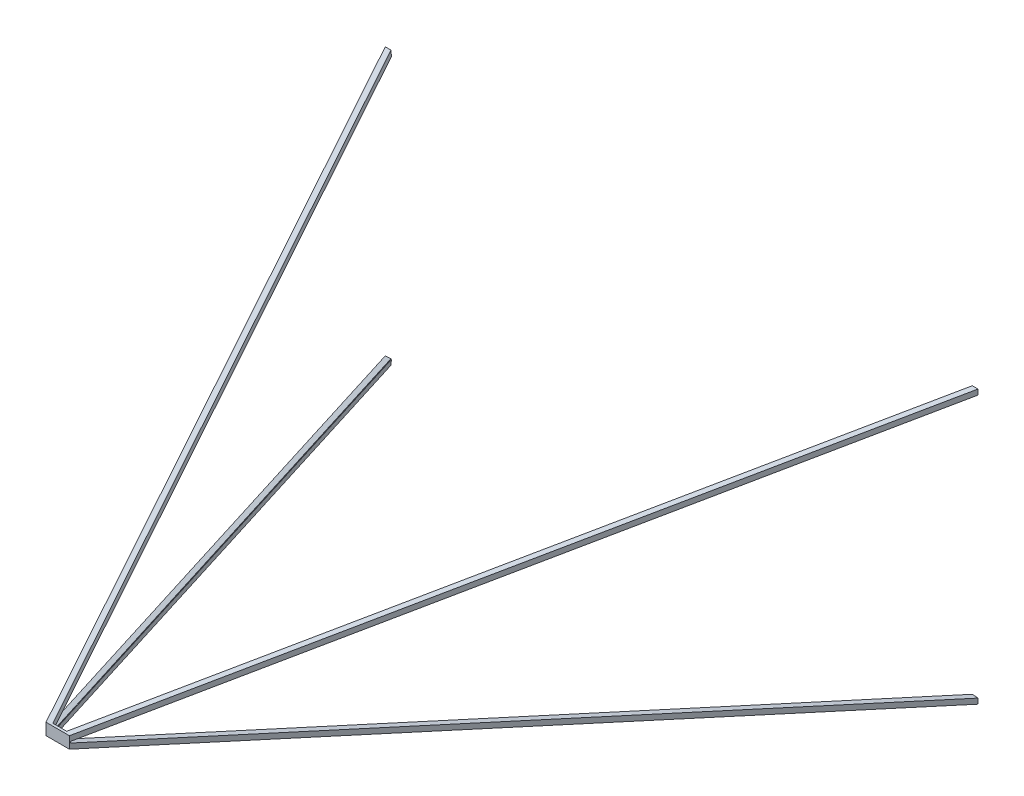
ISO-10303-21;
HEADER;
FILE_DESCRIPTION(('STEP AP214'),'2;1');
FILE_NAME('part.step','',(''),(''),'','','');
FILE_SCHEMA(('AUTOMOTIVE_DESIGN { 1 0 10303 214 1 1 1 1 }'));
ENDSEC;
DATA;
#1=APPLICATION_CONTEXT('core data for automotive mechanical design processes');
#2=APPLICATION_PROTOCOL_DEFINITION('international standard','automotive_design',2000,#1);
#3=PRODUCT_CONTEXT('',#1,'mechanical');
#4=PRODUCT('Part','Part','',(#3));
#5=PRODUCT_RELATED_PRODUCT_CATEGORY('part','',(#4));
#6=PRODUCT_DEFINITION_FORMATION('','',#4);
#7=PRODUCT_DEFINITION_CONTEXT('part definition',#1,'design');
#8=PRODUCT_DEFINITION('design','',#6,#7);
#9=PRODUCT_DEFINITION_SHAPE('','',#8);
#10=(LENGTH_UNIT() NAMED_UNIT(*) SI_UNIT(.MILLI.,.METRE.));
#11=(NAMED_UNIT(*) PLANE_ANGLE_UNIT() SI_UNIT($,.RADIAN.));
#12=(NAMED_UNIT(*) SI_UNIT($,.STERADIAN.) SOLID_ANGLE_UNIT());
#13=UNCERTAINTY_MEASURE_WITH_UNIT(LENGTH_MEASURE(1.E-05),#10,'distance_accuracy_value','');
#14=(GEOMETRIC_REPRESENTATION_CONTEXT(3) GLOBAL_UNCERTAINTY_ASSIGNED_CONTEXT((#13)) GLOBAL_UNIT_ASSIGNED_CONTEXT((#10,
#11,#12)) REPRESENTATION_CONTEXT('',''));
#15=CARTESIAN_POINT('',(0.,0.,0.));
#16=DIRECTION('',(0.,0.,1.));
#17=DIRECTION('',(1.,0.,0.));
#18=AXIS2_PLACEMENT_3D('',#15,#16,#17);
#19=CARTESIAN_POINT('',(0.,0.,2.54));
#20=DIRECTION('',(0.,0.,-1.));
#21=DIRECTION('',(-1.,0.,0.));
#22=AXIS2_PLACEMENT_3D('',#19,#20,#21);
#23=PLANE('',#22);
#24=DIRECTION('',(0.0911346627721718,-0.99583857790377,0.));
#25=VECTOR('',#24,1.);
#26=CARTESIAN_POINT('',(449.22584149141,41.1111263223435,2.54));
#27=LINE('',#26,#25);
#28=CARTESIAN_POINT('',(472.535833423273,-213.599743398054,2.54000000000002));
#29=VERTEX_POINT('',#28);
#30=CARTESIAN_POINT('',(473.327465958709,-222.25,2.53999999999999));
#31=VERTEX_POINT('',#30);
#32=EDGE_CURVE('E250',#29,#31,#27,.T.);
#33=ORIENTED_EDGE('',*,*,#32,.F.);
#34=DIRECTION('',(1.,0.,0.));
#35=VECTOR('',#34,1.);
#36=CARTESIAN_POINT('',(0.,-213.599743398054,2.54));
#37=LINE('',#36,#35);
#38=CARTESIAN_POINT('',(473.29373492651,-213.599743398054,2.54));
#39=VERTEX_POINT('',#38);
#40=EDGE_CURVE('E349',#29,#39,#37,.T.);
#41=ORIENTED_EDGE('',*,*,#40,.T.);
#42=DIRECTION('',(0.,1.,0.));
#43=VECTOR('',#42,1.);
#44=CARTESIAN_POINT('',(473.29373492651,0.,2.54));
#45=LINE('',#44,#43);
#46=CARTESIAN_POINT('',(473.29373492651,-212.895267173679,2.54000000000001));
#47=VERTEX_POINT('',#46);
#48=EDGE_CURVE('E369',#39,#47,#45,.T.);
#49=ORIENTED_EDGE('',*,*,#48,.T.);
#50=DIRECTION('',(-0.996888691620392,0.0788221829143416,0.));
#51=VECTOR('',#50,1.);
#52=CARTESIAN_POINT('',(-13.7881153001558,-174.38258765836,2.54));
#53=LINE('',#52,#51);
#54=CARTESIAN_POINT('',(482.6,-213.631096694104,2.54000000000038));
#55=VERTEX_POINT('',#54);
#56=EDGE_CURVE('E318',#55,#47,#53,.T.);
#57=ORIENTED_EDGE('',*,*,#56,.F.);
#58=DIRECTION('',(0.,1.,0.));
#59=VECTOR('',#58,1.);
#60=CARTESIAN_POINT('',(482.6,-222.25,2.54));
#61=LINE('',#60,#59);
#62=CARTESIAN_POINT('',(482.6,-222.25,2.54));
#63=VERTEX_POINT('',#62);
#64=EDGE_CURVE('E383',#63,#55,#61,.T.);
#65=ORIENTED_EDGE('',*,*,#64,.F.);
#66=DIRECTION('',(1.,0.,0.));
#67=VECTOR('',#66,1.);
#68=CARTESIAN_POINT('',(-482.6,-222.25,2.54));
#69=LINE('',#68,#67);
#70=EDGE_CURVE('E393',#31,#63,#69,.T.);
#71=ORIENTED_EDGE('',*,*,#70,.F.);
#72=EDGE_LOOP('',(#33,#41,#49,#57,#65,#71));
#73=FACE_BOUND('',#72,.T.);
#74=ADVANCED_FACE('F35',(#73),#23,.T.);
#75=CARTESIAN_POINT('',(482.6,-213.96302682185,0.804914990824813));
#76=DIRECTION('',(0.,0.978776359624033,-0.204931300296282));
#77=DIRECTION('',(0.,0.204931300296282,0.978776359624033));
#78=AXIS2_PLACEMENT_3D('',#75,#76,#77);
#79=PLANE('',#78);
#80=DIRECTION('',(0.40775601315611,-0.187120910146982,-0.893711809657229));
#81=VECTOR('',#80,1.);
#82=CARTESIAN_POINT('',(474.869163518275,-214.670518167678,-2.57414815342932));
#83=LINE('',#82,#81);
#84=CARTESIAN_POINT('',(12.84875008994,-2.64745173138731,1010.07333333333));
#85=VERTEX_POINT('',#84);
#86=EDGE_CURVE('E11',#85,#29,#83,.T.);
#87=ORIENTED_EDGE('',*,*,#86,.F.);
#88=DIRECTION('',(-1.,0.,0.));
#89=VECTOR('',#88,1.);
#90=CARTESIAN_POINT('',(0.,-2.64745173138712,1010.07333333333));
#91=LINE('',#90,#89);
#92=CARTESIAN_POINT('',(13.6066515931767,-2.64745173138715,1010.07333333333));
#93=VERTEX_POINT('',#92);
#94=EDGE_CURVE('E324',#93,#85,#91,.T.);
#95=ORIENTED_EDGE('',*,*,#94,.F.);
#96=DIRECTION('',(-0.407756013156111,0.187120910146982,0.893711809657229));
#97=VECTOR('',#96,1.);
#98=CARTESIAN_POINT('',(475.501052553644,-214.612690528314,-2.29795644303397));
#99=LINE('',#98,#97);
#100=EDGE_CURVE('E327',#39,#93,#99,.T.);
#101=ORIENTED_EDGE('',*,*,#100,.F.);
#102=ORIENTED_EDGE('',*,*,#40,.F.);
#103=EDGE_LOOP('',(#87,#95,#101,#102));
#104=FACE_BOUND('',#103,.T.);
#105=ADVANCED_FACE('F501',(#104),#79,.T.);
#106=DIRECTION('',(-0.0911346627721718,0.99583857790377,0.));
#107=VECTOR('',#106,1.);
#108=CARTESIAN_POINT('',(-449.22584149141,-41.1111263223434,2.54));
#109=LINE('',#108,#107);
#110=CARTESIAN_POINT('',(-472.535833423273,213.599743398054,2.54000000000002));
#111=VERTEX_POINT('',#110);
#112=CARTESIAN_POINT('',(-473.327465958709,222.25,2.53999999999999));
#113=VERTEX_POINT('',#112);
#114=EDGE_CURVE('E273',#111,#113,#109,.T.);
#115=ORIENTED_EDGE('',*,*,#114,.F.);
#116=DIRECTION('',(-1.,0.,0.));
#117=VECTOR('',#116,1.);
#118=CARTESIAN_POINT('',(0.,213.599743398054,2.54));
#119=LINE('',#118,#117);
#120=CARTESIAN_POINT('',(-473.29373492651,213.599743398054,2.54));
#121=VERTEX_POINT('',#120);
#122=EDGE_CURVE('E355',#111,#121,#119,.T.);
#123=ORIENTED_EDGE('',*,*,#122,.T.);
#124=DIRECTION('',(0.,-1.,0.));
#125=VECTOR('',#124,1.);
#126=CARTESIAN_POINT('',(-473.29373492651,0.,2.54));
#127=LINE('',#126,#125);
#128=CARTESIAN_POINT('',(-473.29373492651,212.895267173679,2.54000000000001));
#129=VERTEX_POINT('',#128);
#130=EDGE_CURVE('E363',#121,#129,#127,.T.);
#131=ORIENTED_EDGE('',*,*,#130,.T.);
#132=DIRECTION('',(0.996888691620392,-0.0788221829143416,0.));
#133=VECTOR('',#132,1.);
#134=CARTESIAN_POINT('',(13.7881153001558,174.38258765836,2.54));
#135=LINE('',#134,#133);
#136=CARTESIAN_POINT('',(-482.6,213.631096694104,2.54000000000013));
#137=VERTEX_POINT('',#136);
#138=EDGE_CURVE('E294',#137,#129,#135,.T.);
#139=ORIENTED_EDGE('',*,*,#138,.F.);
#140=DIRECTION('',(0.,-1.,0.));
#141=VECTOR('',#140,1.);
#142=CARTESIAN_POINT('',(-482.6,222.25,2.54));
#143=LINE('',#142,#141);
#144=CARTESIAN_POINT('',(-482.6,222.25,2.54));
#145=VERTEX_POINT('',#144);
#146=EDGE_CURVE('E376',#145,#137,#143,.T.);
#147=ORIENTED_EDGE('',*,*,#146,.F.);
#148=DIRECTION('',(-1.,0.,0.));
#149=VECTOR('',#148,1.);
#150=CARTESIAN_POINT('',(482.6,222.25,2.54));
#151=LINE('',#150,#149);
#152=EDGE_CURVE('E403',#113,#145,#151,.T.);
#153=ORIENTED_EDGE('',*,*,#152,.F.);
#154=EDGE_LOOP('',(#115,#123,#131,#139,#147,#153));
#155=FACE_BOUND('',#154,.T.);
#156=ADVANCED_FACE('F433',(#155),#23,.T.);
#157=CARTESIAN_POINT('',(-482.6,213.96302682185,0.804914990824813));
#158=DIRECTION('',(0.,-0.978776359624033,-0.204931300296282));
#159=DIRECTION('',(0.,0.204931300296282,-0.978776359624033));
#160=AXIS2_PLACEMENT_3D('',#157,#158,#159);
#161=PLANE('',#160);
#162=DIRECTION('',(-0.40775601315611,0.187120910146982,-0.893711809657229));
#163=VECTOR('',#162,1.);
#164=CARTESIAN_POINT('',(-474.869163518275,214.670518167678,-2.57414815342932));
#165=LINE('',#164,#163);
#166=CARTESIAN_POINT('',(-12.8487500899402,2.64745173138731,1010.07333333333));
#167=VERTEX_POINT('',#166);
#168=EDGE_CURVE('E420',#167,#111,#165,.T.);
#169=ORIENTED_EDGE('',*,*,#168,.F.);
#170=DIRECTION('',(1.,0.,0.));
#171=VECTOR('',#170,1.);
#172=CARTESIAN_POINT('',(0.,2.64745173138712,1010.07333333333));
#173=LINE('',#172,#171);
#174=CARTESIAN_POINT('',(-13.6066515931767,2.64745173138715,1010.07333333333));
#175=VERTEX_POINT('',#174);
#176=EDGE_CURVE('E335',#175,#167,#173,.T.);
#177=ORIENTED_EDGE('',*,*,#176,.F.);
#178=DIRECTION('',(0.407756013156111,-0.187120910146982,0.893711809657229));
#179=VECTOR('',#178,1.);
#180=CARTESIAN_POINT('',(-475.501052553644,214.612690528314,-2.29795644303397));
#181=LINE('',#180,#179);
#182=EDGE_CURVE('E338',#121,#175,#181,.T.);
#183=ORIENTED_EDGE('',*,*,#182,.F.);
#184=ORIENTED_EDGE('',*,*,#122,.F.);
#185=EDGE_LOOP('',(#169,#177,#183,#184));
#186=FACE_BOUND('',#185,.T.);
#187=ADVANCED_FACE('F436',(#186),#161,.T.);
#188=DIRECTION('',(0.0911346627721721,0.99583857790377,0.));
#189=VECTOR('',#188,1.);
#190=CARTESIAN_POINT('',(-449.22584149141,41.1111263223436,2.54));
#191=LINE('',#190,#189);
#192=CARTESIAN_POINT('',(-473.327465958709,-222.25,2.53999999999999));
#193=VERTEX_POINT('',#192);
#194=CARTESIAN_POINT('',(-472.535833423273,-213.599743398054,2.53999999999997));
#195=VERTEX_POINT('',#194);
#196=EDGE_CURVE('E50',#193,#195,#191,.T.);
#197=ORIENTED_EDGE('',*,*,#196,.F.);
#198=CARTESIAN_POINT('',(-482.6,-222.25,2.54));
#199=VERTEX_POINT('',#198);
#200=EDGE_CURVE('E389',#199,#193,#69,.T.);
#201=ORIENTED_EDGE('',*,*,#200,.F.);
#202=CARTESIAN_POINT('',(-482.6,-213.631096694104,2.54000000000021));
#203=VERTEX_POINT('',#202);
#204=EDGE_CURVE('E398',#203,#199,#143,.T.);
#205=ORIENTED_EDGE('',*,*,#204,.F.);
#206=DIRECTION('',(-0.996888691620392,-0.0788221829143416,0.));
#207=VECTOR('',#206,1.);
#208=CARTESIAN_POINT('',(13.7881153001558,-174.38258765836,2.54));
#209=LINE('',#208,#207);
#210=CARTESIAN_POINT('',(-473.29373492651,-212.895267173679,2.54000000000009));
#211=VERTEX_POINT('',#210);
#212=EDGE_CURVE('E297',#211,#203,#209,.T.);
#213=ORIENTED_EDGE('',*,*,#212,.F.);
#214=CARTESIAN_POINT('',(-473.29373492651,-213.599743398054,2.54));
#215=VERTEX_POINT('',#214);
#216=EDGE_CURVE('E352',#211,#215,#127,.T.);
#217=ORIENTED_EDGE('',*,*,#216,.T.);
#218=EDGE_CURVE('E359',#215,#195,#37,.T.);
#219=ORIENTED_EDGE('',*,*,#218,.T.);
#220=EDGE_LOOP('',(#197,#201,#205,#213,#217,#219));
#221=FACE_BOUND('',#220,.T.);
#222=ADVANCED_FACE('F518',(#221),#23,.T.);
#223=CARTESIAN_POINT('',(-474.897184329227,-222.25,-0.974409649790182));
#224=DIRECTION('',(0.909781378437756,0.,-0.415087753912226));
#225=DIRECTION('',(-0.415087753912226,0.,-0.909781378437756));
#226=AXIS2_PLACEMENT_3D('',#223,#224,#225);
#227=PLANE('',#226);
#228=DIRECTION('',(-0.407756013156111,-0.187120910146982,-0.893711809657229));
#229=VECTOR('',#228,1.);
#230=CARTESIAN_POINT('',(-475.554803861525,-213.932881000022,-2.41576752879966));
#231=LINE('',#230,#229);
#232=CARTESIAN_POINT('',(-13.6066515931769,-1.94297550701239,1010.07333333333));
#233=VERTEX_POINT('',#232);
#234=EDGE_CURVE('E416',#233,#211,#231,.T.);
#235=ORIENTED_EDGE('',*,*,#234,.F.);
#236=DIRECTION('',(0.,1.,0.));
#237=VECTOR('',#236,1.);
#238=CARTESIAN_POINT('',(-13.6066515931767,0.,1010.07333333333));
#239=LINE('',#238,#237);
#240=CARTESIAN_POINT('',(-13.6066515931767,-2.64745173138715,1010.07333333333));
#241=VERTEX_POINT('',#240);
#242=EDGE_CURVE('E341',#241,#233,#239,.T.);
#243=ORIENTED_EDGE('',*,*,#242,.F.);
#244=DIRECTION('',(0.407756013156111,0.187120910146982,0.893711809657229));
#245=VECTOR('',#244,1.);
#246=CARTESIAN_POINT('',(-475.501052553644,-214.612690528314,-2.29795644303396));
#247=LINE('',#246,#245);
#248=EDGE_CURVE('E344',#215,#241,#247,.T.);
#249=ORIENTED_EDGE('',*,*,#248,.F.);
#250=ORIENTED_EDGE('',*,*,#216,.F.);
#251=EDGE_LOOP('',(#235,#243,#249,#250));
#252=FACE_BOUND('',#251,.T.);
#253=ADVANCED_FACE('F529',(#252),#227,.T.);
#254=CARTESIAN_POINT('',(474.897184329227,222.25,-0.974409649790182));
#255=DIRECTION('',(-0.909781378437756,0.,-0.415087753912226));
#256=DIRECTION('',(-0.415087753912226,0.,0.909781378437756));
#257=AXIS2_PLACEMENT_3D('',#254,#255,#256);
#258=PLANE('',#257);
#259=DIRECTION('',(0.407756013156111,0.187120910146982,-0.893711809657229));
#260=VECTOR('',#259,1.);
#261=CARTESIAN_POINT('',(475.554803861525,213.932881000022,-2.41576752879966));
#262=LINE('',#261,#260);
#263=CARTESIAN_POINT('',(13.6066515931769,1.94297550701236,1010.07333333333));
#264=VERTEX_POINT('',#263);
#265=CARTESIAN_POINT('',(473.29373492651,212.895267173679,2.54000000000008));
#266=VERTEX_POINT('',#265);
#267=EDGE_CURVE('E412',#264,#266,#262,.T.);
#268=ORIENTED_EDGE('',*,*,#267,.F.);
#269=DIRECTION('',(0.,-1.,0.));
#270=VECTOR('',#269,1.);
#271=CARTESIAN_POINT('',(13.6066515931767,0.,1010.07333333333));
#272=LINE('',#271,#270);
#273=CARTESIAN_POINT('',(13.6066515931767,2.64745173138715,1010.07333333333));
#274=VERTEX_POINT('',#273);
#275=EDGE_CURVE('E330',#274,#264,#272,.T.);
#276=ORIENTED_EDGE('',*,*,#275,.F.);
#277=DIRECTION('',(-0.407756013156111,-0.187120910146982,0.893711809657229));
#278=VECTOR('',#277,1.);
#279=CARTESIAN_POINT('',(475.501052553644,214.612690528314,-2.29795644303396));
#280=LINE('',#279,#278);
#281=CARTESIAN_POINT('',(473.29373492651,213.599743398054,2.54));
#282=VERTEX_POINT('',#281);
#283=EDGE_CURVE('E333',#282,#274,#280,.T.);
#284=ORIENTED_EDGE('',*,*,#283,.F.);
#285=EDGE_CURVE('E358',#266,#282,#45,.T.);
#286=ORIENTED_EDGE('',*,*,#285,.F.);
#287=EDGE_LOOP('',(#268,#276,#284,#286));
#288=FACE_BOUND('',#287,.T.);
#289=ADVANCED_FACE('F470',(#288),#258,.T.);
#290=DIRECTION('',(-0.0911346627721718,-0.99583857790377,0.));
#291=VECTOR('',#290,1.);
#292=CARTESIAN_POINT('',(449.22584149141,-41.1111263223435,2.54));
#293=LINE('',#292,#291);
#294=CARTESIAN_POINT('',(473.327465958709,222.25,2.53999999999999));
#295=VERTEX_POINT('',#294);
#296=CARTESIAN_POINT('',(472.535833423273,213.599743398054,2.53999999999997));
#297=VERTEX_POINT('',#296);
#298=EDGE_CURVE('E58',#295,#297,#293,.T.);
#299=ORIENTED_EDGE('',*,*,#298,.F.);
#300=CARTESIAN_POINT('',(482.6,222.25,2.54));
#301=VERTEX_POINT('',#300);
#302=EDGE_CURVE('E388',#301,#295,#151,.T.);
#303=ORIENTED_EDGE('',*,*,#302,.F.);
#304=CARTESIAN_POINT('',(482.6,213.631096694104,2.54000000000029));
#305=VERTEX_POINT('',#304);
#306=EDGE_CURVE('E408',#305,#301,#61,.T.);
#307=ORIENTED_EDGE('',*,*,#306,.F.);
#308=DIRECTION('',(0.996888691620392,0.0788221829143416,0.));
#309=VECTOR('',#308,1.);
#310=CARTESIAN_POINT('',(-13.7881153001558,174.38258765836,2.54));
#311=LINE('',#310,#309);
#312=EDGE_CURVE('E321',#266,#305,#311,.T.);
#313=ORIENTED_EDGE('',*,*,#312,.F.);
#314=ORIENTED_EDGE('',*,*,#285,.T.);
#315=EDGE_CURVE('E366',#282,#297,#119,.T.);
#316=ORIENTED_EDGE('',*,*,#315,.T.);
#317=EDGE_LOOP('',(#299,#303,#307,#313,#314,#316));
#318=FACE_BOUND('',#317,.T.);
#319=ADVANCED_FACE('F475',(#318),#23,.T.);
#320=CARTESIAN_POINT('',(0.,0.,1018.54));
#321=DIRECTION('',(0.,0.,1.));
#322=DIRECTION('',(0.,-1.,0.));
#323=AXIS2_PLACEMENT_3D('',#320,#321,#322);
#324=PLANE('',#323);
#325=DIRECTION('',(-1.,0.,0.));
#326=VECTOR('',#325,1.);
#327=CARTESIAN_POINT('',(-19.05,-9.525,1018.54));
#328=LINE('',#327,#326);
#329=CARTESIAN_POINT('',(19.05,-9.525,1018.54));
#330=VERTEX_POINT('',#329);
#331=CARTESIAN_POINT('',(-19.05,-9.525,1018.54));
#332=VERTEX_POINT('',#331);
#333=EDGE_CURVE('E372',#330,#332,#328,.T.);
#334=ORIENTED_EDGE('',*,*,#333,.F.);
#335=DIRECTION('',(0.,-1.,0.));
#336=VECTOR('',#335,1.);
#337=CARTESIAN_POINT('',(19.05,-9.525,1018.54));
#338=LINE('',#337,#336);
#339=CARTESIAN_POINT('',(19.05,9.525,1018.54));
#340=VERTEX_POINT('',#339);
#341=EDGE_CURVE('E362',#340,#330,#338,.T.);
#342=ORIENTED_EDGE('',*,*,#341,.F.);
#343=DIRECTION('',(1.,0.,0.));
#344=VECTOR('',#343,1.);
#345=CARTESIAN_POINT('',(19.05,9.525,1018.54));
#346=LINE('',#345,#344);
#347=CARTESIAN_POINT('',(-19.05,9.525,1018.54));
#348=VERTEX_POINT('',#347);
#349=EDGE_CURVE('E379',#348,#340,#346,.T.);
#350=ORIENTED_EDGE('',*,*,#349,.F.);
#351=DIRECTION('',(0.,1.,0.));
#352=VECTOR('',#351,1.);
#353=CARTESIAN_POINT('',(-19.05,9.525,1018.54));
#354=LINE('',#353,#352);
#355=EDGE_CURVE('E384',#332,#348,#354,.T.);
#356=ORIENTED_EDGE('',*,*,#355,.F.);
#357=EDGE_LOOP('',(#334,#342,#350,#356));
#358=FACE_BOUND('',#357,.T.);
#359=ADVANCED_FACE('F562',(#358),#324,.T.);
#360=CARTESIAN_POINT('',(482.6,-222.25,2.54));
#361=DIRECTION('',(0.,0.978776359624033,-0.204931300296282));
#362=DIRECTION('',(0.,0.204931300296282,0.978776359624033));
#363=AXIS2_PLACEMENT_3D('',#360,#361,#362);
#364=PLANE('',#363);
#365=DIRECTION('',(-1.,0.,0.));
#366=VECTOR('',#365,1.);
#367=CARTESIAN_POINT('',(11.3191635182753,-10.2324913458283,1015.16093685575));
#368=LINE('',#367,#366);
#369=CARTESIAN_POINT('',(11.3191635182753,-10.2324913458283,1015.16093685575));
#370=VERTEX_POINT('',#369);
#371=CARTESIAN_POINT('',(-11.3191635182737,-10.2324913458284,1015.16093685575));
#372=VERTEX_POINT('',#371);
#373=EDGE_CURVE('E225',#370,#372,#368,.T.);
#374=ORIENTED_EDGE('',*,*,#373,.F.);
#375=DIRECTION('',(-0.40775601315611,0.187120910146982,0.893711809657229));
#376=VECTOR('',#375,1.);
#377=CARTESIAN_POINT('',(473.327465958709,-222.25,2.53999999999999));
#378=LINE('',#377,#376);
#379=EDGE_CURVE('E239',#31,#370,#378,.T.);
#380=ORIENTED_EDGE('',*,*,#379,.F.);
#381=ORIENTED_EDGE('',*,*,#70,.T.);
#382=DIRECTION('',(-0.407756013156111,0.187120910146982,0.893711809657229));
#383=VECTOR('',#382,1.);
#384=CARTESIAN_POINT('',(482.6,-222.25,2.54));
#385=LINE('',#384,#383);
#386=EDGE_CURVE('E375',#63,#330,#385,.T.);
#387=ORIENTED_EDGE('',*,*,#386,.T.);
#388=ORIENTED_EDGE('',*,*,#333,.T.);
#389=DIRECTION('',(0.407756013156111,0.187120910146982,0.893711809657229));
#390=VECTOR('',#389,1.);
#391=CARTESIAN_POINT('',(-482.6,-222.25,2.54));
#392=LINE('',#391,#390);
#393=EDGE_CURVE('E387',#199,#332,#392,.T.);
#394=ORIENTED_EDGE('',*,*,#393,.F.);
#395=ORIENTED_EDGE('',*,*,#200,.T.);
#396=DIRECTION('',(-0.407756013156112,-0.187120910146982,-0.893711809657228));
#397=VECTOR('',#396,1.);
#398=CARTESIAN_POINT('',(-11.3191635182737,-10.2324913458284,1015.16093685575));
#399=LINE('',#398,#397);
#400=EDGE_CURVE('E242',#372,#193,#399,.T.);
#401=ORIENTED_EDGE('',*,*,#400,.F.);
#402=EDGE_LOOP('',(#374,#380,#381,#387,#388,#394,#395,#401));
#403=FACE_BOUND('',#402,.T.);
#404=ADVANCED_FACE('F514',(#403),#364,.F.);
#405=CARTESIAN_POINT('',(-482.6,-222.25,2.54));
#406=DIRECTION('',(0.909781378437756,0.,-0.415087753912226));
#407=DIRECTION('',(-0.415087753912226,0.,-0.909781378437756));
#408=AXIS2_PLACEMENT_3D('',#405,#406,#407);
#409=PLANE('',#408);
#410=DIRECTION('',(0.,1.,0.));
#411=VECTOR('',#410,1.);
#412=CARTESIAN_POINT('',(-19.7076195322984,-1.20788100002159,1017.09864212099));
#413=LINE('',#412,#411);
#414=CARTESIAN_POINT('',(-19.7076195322984,-1.20788100002159,1017.09864212099));
#415=VERTEX_POINT('',#414);
#416=CARTESIAN_POINT('',(-19.7076195322983,1.20788100002159,1017.09864212099));
#417=VERTEX_POINT('',#416);
#418=EDGE_CURVE('E288',#415,#417,#413,.T.);
#419=ORIENTED_EDGE('',*,*,#418,.F.);
#420=DIRECTION('',(0.407756013156111,0.187120910146982,0.893711809657229));
#421=VECTOR('',#420,1.);
#422=CARTESIAN_POINT('',(-482.6,-213.631096694104,2.54000000000021));
#423=LINE('',#422,#421);
#424=EDGE_CURVE('E275',#203,#415,#423,.T.);
#425=ORIENTED_EDGE('',*,*,#424,.F.);
#426=ORIENTED_EDGE('',*,*,#204,.T.);
#427=ORIENTED_EDGE('',*,*,#393,.T.);
#428=ORIENTED_EDGE('',*,*,#355,.T.);
#429=DIRECTION('',(0.407756013156111,-0.187120910146982,0.893711809657229));
#430=VECTOR('',#429,1.);
#431=CARTESIAN_POINT('',(-482.6,222.25,2.54));
#432=LINE('',#431,#430);
#433=EDGE_CURVE('E382',#145,#348,#432,.T.);
#434=ORIENTED_EDGE('',*,*,#433,.F.);
#435=ORIENTED_EDGE('',*,*,#146,.T.);
#436=DIRECTION('',(-0.407756013156111,0.187120910146982,-0.893711809657229));
#437=VECTOR('',#436,1.);
#438=CARTESIAN_POINT('',(-19.7076195322983,1.20788100002159,1017.09864212099));
#439=LINE('',#438,#437);
#440=EDGE_CURVE('E279',#417,#137,#439,.T.);
#441=ORIENTED_EDGE('',*,*,#440,.F.);
#442=EDGE_LOOP('',(#419,#425,#426,#427,#428,#434,#435,#441));
#443=FACE_BOUND('',#442,.T.);
#444=ADVANCED_FACE('F448',(#443),#409,.F.);
#445=CARTESIAN_POINT('',(-482.6,222.25,2.54));
#446=DIRECTION('',(0.,-0.978776359624033,-0.204931300296282));
#447=DIRECTION('',(0.,0.204931300296282,-0.978776359624033));
#448=AXIS2_PLACEMENT_3D('',#445,#446,#447);
#449=PLANE('',#448);
#450=DIRECTION('',(1.,0.,0.));
#451=VECTOR('',#450,1.);
#452=CARTESIAN_POINT('',(-11.3191635182753,10.2324913458282,1015.16093685575));
#453=LINE('',#452,#451);
#454=CARTESIAN_POINT('',(-11.3191635182753,10.2324913458282,1015.16093685575));
#455=VERTEX_POINT('',#454);
#456=CARTESIAN_POINT('',(11.3191635182753,10.2324913458283,1015.16093685575));
#457=VERTEX_POINT('',#456);
#458=EDGE_CURVE('E252',#455,#457,#453,.T.);
#459=ORIENTED_EDGE('',*,*,#458,.F.);
#460=DIRECTION('',(0.40775601315611,-0.187120910146982,0.893711809657229));
#461=VECTOR('',#460,1.);
#462=CARTESIAN_POINT('',(-473.327465958709,222.25,2.53999999999999));
#463=LINE('',#462,#461);
#464=EDGE_CURVE('E257',#113,#455,#463,.T.);
#465=ORIENTED_EDGE('',*,*,#464,.F.);
#466=ORIENTED_EDGE('',*,*,#152,.T.);
#467=ORIENTED_EDGE('',*,*,#433,.T.);
#468=ORIENTED_EDGE('',*,*,#349,.T.);
#469=DIRECTION('',(-0.407756013156111,-0.187120910146982,0.893711809657229));
#470=VECTOR('',#469,1.);
#471=CARTESIAN_POINT('',(482.6,222.25,2.54));
#472=LINE('',#471,#470);
#473=EDGE_CURVE('E378',#301,#340,#472,.T.);
#474=ORIENTED_EDGE('',*,*,#473,.F.);
#475=ORIENTED_EDGE('',*,*,#302,.T.);
#476=DIRECTION('',(0.40775601315611,0.187120910146982,-0.893711809657229));
#477=VECTOR('',#476,1.);
#478=CARTESIAN_POINT('',(11.3191635182753,10.2324913458283,1015.16093685575));
#479=LINE('',#478,#477);
#480=EDGE_CURVE('E265',#457,#295,#479,.T.);
#481=ORIENTED_EDGE('',*,*,#480,.F.);
#482=EDGE_LOOP('',(#459,#465,#466,#467,#468,#474,#475,#481));
#483=FACE_BOUND('',#482,.T.);
#484=ADVANCED_FACE('F451',(#483),#449,.F.);
#485=CARTESIAN_POINT('',(482.6,222.25,2.54));
#486=DIRECTION('',(-0.909781378437756,0.,-0.415087753912226));
#487=DIRECTION('',(-0.415087753912226,0.,0.909781378437756));
#488=AXIS2_PLACEMENT_3D('',#485,#486,#487);
#489=PLANE('',#488);
#490=DIRECTION('',(0.,-1.,0.));
#491=VECTOR('',#490,1.);
#492=CARTESIAN_POINT('',(19.7076195322984,1.20788100002159,1017.09864212099));
#493=LINE('',#492,#491);
#494=CARTESIAN_POINT('',(19.7076195322984,1.20788100002159,1017.09864212099));
#495=VERTEX_POINT('',#494);
#496=CARTESIAN_POINT('',(19.7076195322983,-1.20788100002159,1017.09864212099));
#497=VERTEX_POINT('',#496);
#498=EDGE_CURVE('E312',#495,#497,#493,.T.);
#499=ORIENTED_EDGE('',*,*,#498,.F.);
#500=DIRECTION('',(-0.407756013156111,-0.187120910146982,0.893711809657229));
#501=VECTOR('',#500,1.);
#502=CARTESIAN_POINT('',(482.6,213.631096694104,2.54000000000029));
#503=LINE('',#502,#501);
#504=EDGE_CURVE('E299',#305,#495,#503,.T.);
#505=ORIENTED_EDGE('',*,*,#504,.F.);
#506=ORIENTED_EDGE('',*,*,#306,.T.);
#507=ORIENTED_EDGE('',*,*,#473,.T.);
#508=ORIENTED_EDGE('',*,*,#341,.T.);
#509=ORIENTED_EDGE('',*,*,#386,.F.);
#510=ORIENTED_EDGE('',*,*,#64,.T.);
#511=DIRECTION('',(0.407756013156111,-0.187120910146982,-0.893711809657229));
#512=VECTOR('',#511,1.);
#513=CARTESIAN_POINT('',(19.7076195322983,-1.20788100002159,1017.09864212099));
#514=LINE('',#513,#512);
#515=EDGE_CURVE('E303',#497,#55,#514,.T.);
#516=ORIENTED_EDGE('',*,*,#515,.F.);
#517=EDGE_LOOP('',(#499,#505,#506,#507,#508,#509,#510,#516));
#518=FACE_BOUND('',#517,.T.);
#519=ADVANCED_FACE('F37',(#518),#489,.F.);
#520=CARTESIAN_POINT('',(0.,0.,1010.07333333333));
#521=DIRECTION('',(0.,0.,1.));
#522=DIRECTION('',(0.,-1.,0.));
#523=AXIS2_PLACEMENT_3D('',#520,#521,#522);
#524=PLANE('',#523);
#525=ORIENTED_EDGE('',*,*,#94,.T.);
#526=CARTESIAN_POINT('',(-12.848750089938,-2.64745173138723,1010.07333333333));
#527=VERTEX_POINT('',#526);
#528=EDGE_CURVE('E328',#85,#527,#91,.T.);
#529=ORIENTED_EDGE('',*,*,#528,.T.);
#530=EDGE_CURVE('E329',#527,#241,#91,.T.);
#531=ORIENTED_EDGE('',*,*,#530,.T.);
#532=ORIENTED_EDGE('',*,*,#242,.T.);
#533=CARTESIAN_POINT('',(-13.6066515931771,1.94297550701245,1010.07333333333));
#534=VERTEX_POINT('',#533);
#535=EDGE_CURVE('E345',#233,#534,#239,.T.);
#536=ORIENTED_EDGE('',*,*,#535,.T.);
#537=EDGE_CURVE('E346',#534,#175,#239,.T.);
#538=ORIENTED_EDGE('',*,*,#537,.T.);
#539=ORIENTED_EDGE('',*,*,#176,.T.);
#540=CARTESIAN_POINT('',(12.8487500899399,2.64745173138721,1010.07333333333));
#541=VERTEX_POINT('',#540);
#542=EDGE_CURVE('E339',#167,#541,#173,.T.);
#543=ORIENTED_EDGE('',*,*,#542,.T.);
#544=EDGE_CURVE('E340',#541,#274,#173,.T.);
#545=ORIENTED_EDGE('',*,*,#544,.T.);
#546=ORIENTED_EDGE('',*,*,#275,.T.);
#547=CARTESIAN_POINT('',(13.6066515931771,-1.94297550701245,1010.07333333333));
#548=VERTEX_POINT('',#547);
#549=EDGE_CURVE('E334',#264,#548,#272,.T.);
#550=ORIENTED_EDGE('',*,*,#549,.T.);
#551=EDGE_CURVE('E323',#548,#93,#272,.T.);
#552=ORIENTED_EDGE('',*,*,#551,.T.);
#553=EDGE_LOOP('',(#525,#529,#531,#532,#536,#538,#539,#543,#545,#546,#550,#552));
#554=FACE_BOUND('',#553,.T.);
#555=ADVANCED_FACE('F464',(#554),#524,.F.);
#556=DIRECTION('',(0.407756013156112,0.187120910146982,0.893711809657228));
#557=VECTOR('',#556,1.);
#558=CARTESIAN_POINT('',(-314.390218079329,-141.02607060323,349.160526781246));
#559=LINE('',#558,#557);
#560=EDGE_CURVE('E43',#195,#527,#559,.T.);
#561=ORIENTED_EDGE('',*,*,#560,.F.);
#562=ORIENTED_EDGE('',*,*,#218,.F.);
#563=ORIENTED_EDGE('',*,*,#248,.T.);
#564=ORIENTED_EDGE('',*,*,#530,.F.);
#565=EDGE_LOOP('',(#561,#562,#563,#564));
#566=FACE_BOUND('',#565,.T.);
#567=ADVANCED_FACE('F525',(#566),#79,.T.);
#568=DIRECTION('',(0.407756013156111,-0.187120910146982,0.893711809657229));
#569=VECTOR('',#568,1.);
#570=CARTESIAN_POINT('',(-441.639597746319,198.369053536194,71.9189308058987));
#571=LINE('',#570,#569);
#572=EDGE_CURVE('E414',#129,#534,#571,.T.);
#573=ORIENTED_EDGE('',*,*,#572,.F.);
#574=ORIENTED_EDGE('',*,*,#130,.F.);
#575=ORIENTED_EDGE('',*,*,#182,.T.);
#576=ORIENTED_EDGE('',*,*,#537,.F.);
#577=EDGE_LOOP('',(#573,#574,#575,#576));
#578=FACE_BOUND('',#577,.T.);
#579=ADVANCED_FACE('F441',(#578),#227,.T.);
#580=DIRECTION('',(-0.407756013156111,-0.187120910146982,0.893711809657229));
#581=VECTOR('',#580,1.);
#582=CARTESIAN_POINT('',(314.39021807933,141.026070603231,349.160526781246));
#583=LINE('',#582,#581);
#584=EDGE_CURVE('E418',#297,#541,#583,.T.);
#585=ORIENTED_EDGE('',*,*,#584,.F.);
#586=ORIENTED_EDGE('',*,*,#315,.F.);
#587=ORIENTED_EDGE('',*,*,#283,.T.);
#588=ORIENTED_EDGE('',*,*,#544,.F.);
#589=EDGE_LOOP('',(#585,#586,#587,#588));
#590=FACE_BOUND('',#589,.T.);
#591=ADVANCED_FACE('F473',(#590),#161,.T.);
#592=DIRECTION('',(-0.407756013156111,0.187120910146982,0.893711809657229));
#593=VECTOR('',#592,1.);
#594=CARTESIAN_POINT('',(441.639597746319,-198.369053536194,71.9189308058987));
#595=LINE('',#594,#593);
#596=EDGE_CURVE('E392',#47,#548,#595,.T.);
#597=ORIENTED_EDGE('',*,*,#596,.F.);
#598=ORIENTED_EDGE('',*,*,#48,.F.);
#599=ORIENTED_EDGE('',*,*,#100,.T.);
#600=ORIENTED_EDGE('',*,*,#551,.F.);
#601=EDGE_LOOP('',(#597,#598,#599,#600));
#602=FACE_BOUND('',#601,.T.);
#603=ADVANCED_FACE('F504',(#602),#258,.T.);
#604=CARTESIAN_POINT('',(392.705448417949,7.59072170763678E-12,179.171860840691));
#605=DIRECTION('',(0.909781378437755,0.,0.415087753912229));
#606=DIRECTION('',(0.415087753912229,0.,-0.909781378437755));
#607=AXIS2_PLACEMENT_3D('',#604,#605,#606);
#608=PLANE('',#607);
#609=ORIENTED_EDGE('',*,*,#549,.F.);
#610=DIRECTION('',(-0.407756013156111,-0.187120910146982,0.893711809657229));
#611=VECTOR('',#610,1.);
#612=CARTESIAN_POINT('',(474.897184329227,213.631096694104,-0.974409649789891));
#613=LINE('',#612,#611);
#614=CARTESIAN_POINT('',(12.0048038615254,1.20788100002159,1013.5842324712));
#615=VERTEX_POINT('',#614);
#616=EDGE_CURVE('E300',#264,#615,#613,.T.);
#617=ORIENTED_EDGE('',*,*,#616,.T.);
#618=DIRECTION('',(0.,-1.,0.));
#619=VECTOR('',#618,1.);
#620=CARTESIAN_POINT('',(12.0048038615254,1.20788100002159,1013.5842324712));
#621=LINE('',#620,#619);
#622=CARTESIAN_POINT('',(12.0048038615253,-1.20788100002159,1013.5842324712));
#623=VERTEX_POINT('',#622);
#624=EDGE_CURVE('E302',#615,#623,#621,.T.);
#625=ORIENTED_EDGE('',*,*,#624,.T.);
#626=DIRECTION('',(0.407756013156111,-0.187120910146982,-0.893711809657229));
#627=VECTOR('',#626,1.);
#628=CARTESIAN_POINT('',(12.0048038615253,-1.20788100002159,1013.5842324712));
#629=LINE('',#628,#627);
#630=EDGE_CURVE('E306',#623,#548,#629,.T.);
#631=ORIENTED_EDGE('',*,*,#630,.T.);
#632=EDGE_LOOP('',(#609,#617,#625,#631));
#633=FACE_BOUND('',#632,.T.);
#634=ADVANCED_FACE('F492',(#633),#608,.T.);
#635=CARTESIAN_POINT('',(474.897184329227,213.631096694104,-0.974409649789891));
#636=DIRECTION('',(-0.0776715983029224,0.982336889761229,0.170239119568049));
#637=DIRECTION('',(0.,-0.170754970644706,0.985313523707112));
#638=AXIS2_PLACEMENT_3D('',#635,#636,#637);
#639=PLANE('',#638);
#640=ORIENTED_EDGE('',*,*,#312,.T.);
#641=ORIENTED_EDGE('',*,*,#504,.T.);
#642=DIRECTION('',(0.909781378437756,0.,0.415087753912226));
#643=VECTOR('',#642,1.);
#644=CARTESIAN_POINT('',(12.0048038615254,1.20788100002159,1013.5842324712));
#645=LINE('',#644,#643);
#646=EDGE_CURVE('E309',#615,#495,#645,.T.);
#647=ORIENTED_EDGE('',*,*,#646,.F.);
#648=ORIENTED_EDGE('',*,*,#616,.F.);
#649=ORIENTED_EDGE('',*,*,#267,.T.);
#650=EDGE_LOOP('',(#640,#641,#647,#648,#649));
#651=FACE_BOUND('',#650,.T.);
#652=ADVANCED_FACE('F481',(#651),#639,.F.);
#653=CARTESIAN_POINT('',(12.0048038615253,-1.20788100002159,1013.5842324712));
#654=DIRECTION('',(-0.0776715983029224,-0.982336889761229,0.170239119568049));
#655=DIRECTION('',(0.,-0.170754970644706,-0.985313523707112));
#656=AXIS2_PLACEMENT_3D('',#653,#654,#655);
#657=PLANE('',#656);
#658=ORIENTED_EDGE('',*,*,#56,.T.);
#659=ORIENTED_EDGE('',*,*,#596,.T.);
#660=ORIENTED_EDGE('',*,*,#630,.F.);
#661=DIRECTION('',(0.909781378437756,0.,0.415087753912226));
#662=VECTOR('',#661,1.);
#663=CARTESIAN_POINT('',(12.0048038615253,-1.20788100002159,1013.5842324712));
#664=LINE('',#663,#662);
#665=EDGE_CURVE('E316',#623,#497,#664,.T.);
#666=ORIENTED_EDGE('',*,*,#665,.T.);
#667=ORIENTED_EDGE('',*,*,#515,.T.);
#668=EDGE_LOOP('',(#658,#659,#660,#666,#667));
#669=FACE_BOUND('',#668,.T.);
#670=ADVANCED_FACE('F590',(#669),#657,.F.);
#671=CARTESIAN_POINT('',(12.0048038615254,1.20788100002159,1013.5842324712));
#672=DIRECTION('',(-0.415087753912226,0.,0.909781378437756));
#673=DIRECTION('',(0.909781378437756,0.,0.415087753912226));
#674=AXIS2_PLACEMENT_3D('',#671,#672,#673);
#675=PLANE('',#674);
#676=ORIENTED_EDGE('',*,*,#498,.T.);
#677=ORIENTED_EDGE('',*,*,#665,.F.);
#678=ORIENTED_EDGE('',*,*,#624,.F.);
#679=ORIENTED_EDGE('',*,*,#646,.T.);
#680=EDGE_LOOP('',(#676,#677,#678,#679));
#681=FACE_BOUND('',#680,.T.);
#682=ADVANCED_FACE('F488',(#681),#675,.F.);
#683=CARTESIAN_POINT('',(-392.705448417949,-7.59072170763678E-12,179.171860840691));
#684=DIRECTION('',(-0.909781378437755,0.,0.415087753912229));
#685=DIRECTION('',(0.415087753912229,0.,0.909781378437755));
#686=AXIS2_PLACEMENT_3D('',#683,#684,#685);
#687=PLANE('',#686);
#688=ORIENTED_EDGE('',*,*,#535,.F.);
#689=DIRECTION('',(0.407756013156111,0.187120910146982,0.893711809657229));
#690=VECTOR('',#689,1.);
#691=CARTESIAN_POINT('',(-474.897184329227,-213.631096694104,-0.974409649789974));
#692=LINE('',#691,#690);
#693=CARTESIAN_POINT('',(-12.0048038615254,-1.20788100002159,1013.5842324712));
#694=VERTEX_POINT('',#693);
#695=EDGE_CURVE('E276',#233,#694,#692,.T.);
#696=ORIENTED_EDGE('',*,*,#695,.T.);
#697=DIRECTION('',(0.,1.,0.));
#698=VECTOR('',#697,1.);
#699=CARTESIAN_POINT('',(-12.0048038615254,-1.20788100002159,1013.5842324712));
#700=LINE('',#699,#698);
#701=CARTESIAN_POINT('',(-12.0048038615253,1.20788100002159,1013.5842324712));
#702=VERTEX_POINT('',#701);
#703=EDGE_CURVE('E278',#694,#702,#700,.T.);
#704=ORIENTED_EDGE('',*,*,#703,.T.);
#705=DIRECTION('',(-0.407756013156111,0.187120910146982,-0.893711809657229));
#706=VECTOR('',#705,1.);
#707=CARTESIAN_POINT('',(-12.0048038615253,1.20788100002159,1013.5842324712));
#708=LINE('',#707,#706);
#709=EDGE_CURVE('E282',#702,#534,#708,.T.);
#710=ORIENTED_EDGE('',*,*,#709,.T.);
#711=EDGE_LOOP('',(#688,#696,#704,#710));
#712=FACE_BOUND('',#711,.T.);
#713=ADVANCED_FACE('F533',(#712),#687,.T.);
#714=CARTESIAN_POINT('',(-474.897184329227,-213.631096694104,-0.974409649789974));
#715=DIRECTION('',(0.0776715983029224,-0.982336889761229,0.170239119568049));
#716=DIRECTION('',(0.,-0.170754970644706,-0.985313523707112));
#717=AXIS2_PLACEMENT_3D('',#714,#715,#716);
#718=PLANE('',#717);
#719=ORIENTED_EDGE('',*,*,#212,.T.);
#720=ORIENTED_EDGE('',*,*,#424,.T.);
#721=DIRECTION('',(-0.909781378437756,0.,0.415087753912226));
#722=VECTOR('',#721,1.);
#723=CARTESIAN_POINT('',(-12.0048038615254,-1.20788100002159,1013.5842324712));
#724=LINE('',#723,#722);
#725=EDGE_CURVE('E285',#694,#415,#724,.T.);
#726=ORIENTED_EDGE('',*,*,#725,.F.);
#727=ORIENTED_EDGE('',*,*,#695,.F.);
#728=ORIENTED_EDGE('',*,*,#234,.T.);
#729=EDGE_LOOP('',(#719,#720,#726,#727,#728));
#730=FACE_BOUND('',#729,.T.);
#731=ADVANCED_FACE('F537',(#730),#718,.F.);
#732=CARTESIAN_POINT('',(-12.0048038615253,1.20788100002159,1013.5842324712));
#733=DIRECTION('',(0.0776715983029224,0.982336889761229,0.170239119568049));
#734=DIRECTION('',(0.,-0.170754970644706,0.985313523707112));
#735=AXIS2_PLACEMENT_3D('',#732,#733,#734);
#736=PLANE('',#735);
#737=ORIENTED_EDGE('',*,*,#138,.T.);
#738=ORIENTED_EDGE('',*,*,#572,.T.);
#739=ORIENTED_EDGE('',*,*,#709,.F.);
#740=DIRECTION('',(-0.909781378437756,0.,0.415087753912226));
#741=VECTOR('',#740,1.);
#742=CARTESIAN_POINT('',(-12.0048038615253,1.20788100002159,1013.5842324712));
#743=LINE('',#742,#741);
#744=EDGE_CURVE('E292',#702,#417,#743,.T.);
#745=ORIENTED_EDGE('',*,*,#744,.T.);
#746=ORIENTED_EDGE('',*,*,#440,.T.);
#747=EDGE_LOOP('',(#737,#738,#739,#745,#746));
#748=FACE_BOUND('',#747,.T.);
#749=ADVANCED_FACE('F542',(#748),#736,.F.);
#750=CARTESIAN_POINT('',(-12.0048038615254,-1.20788100002159,1013.5842324712));
#751=DIRECTION('',(0.415087753912226,0.,0.909781378437756));
#752=DIRECTION('',(0.909781378437756,0.,-0.415087753912226));
#753=AXIS2_PLACEMENT_3D('',#750,#751,#752);
#754=PLANE('',#753);
#755=ORIENTED_EDGE('',*,*,#418,.T.);
#756=ORIENTED_EDGE('',*,*,#744,.F.);
#757=ORIENTED_EDGE('',*,*,#703,.F.);
#758=ORIENTED_EDGE('',*,*,#725,.T.);
#759=EDGE_LOOP('',(#755,#756,#757,#758));
#760=FACE_BOUND('',#759,.T.);
#761=ADVANCED_FACE('F541',(#760),#754,.F.);
#762=CARTESIAN_POINT('',(1.76626700997124E-13,205.138707668336,42.9509169180579));
#763=DIRECTION('',(0.,0.978776359624033,0.204931300296282));
#764=DIRECTION('',(0.,-0.204931300296282,0.978776359624033));
#765=AXIS2_PLACEMENT_3D('',#762,#763,#764);
#766=PLANE('',#765);
#767=ORIENTED_EDGE('',*,*,#542,.F.);
#768=DIRECTION('',(0.40775601315611,-0.187120910146982,0.893711809657229));
#769=VECTOR('',#768,1.);
#770=CARTESIAN_POINT('',(-473.327465958709,213.96302682185,0.804914990824806));
#771=LINE('',#770,#769);
#772=CARTESIAN_POINT('',(-11.3191635182753,1.94551816767809,1013.42585184657));
#773=VERTEX_POINT('',#772);
#774=EDGE_CURVE('E260',#167,#773,#771,.T.);
#775=ORIENTED_EDGE('',*,*,#774,.T.);
#776=DIRECTION('',(1.,0.,0.));
#777=VECTOR('',#776,1.);
#778=CARTESIAN_POINT('',(-11.3191635182753,1.94551816767809,1013.42585184657));
#779=LINE('',#778,#777);
#780=CARTESIAN_POINT('',(11.3191635182753,1.94551816767811,1013.42585184657));
#781=VERTEX_POINT('',#780);
#782=EDGE_CURVE('E253',#773,#781,#779,.T.);
#783=ORIENTED_EDGE('',*,*,#782,.T.);
#784=DIRECTION('',(0.40775601315611,0.187120910146982,-0.893711809657229));
#785=VECTOR('',#784,1.);
#786=CARTESIAN_POINT('',(11.3191635182753,1.94551816767811,1013.42585184657));
#787=LINE('',#786,#785);
#788=EDGE_CURVE('E256',#781,#541,#787,.T.);
#789=ORIENTED_EDGE('',*,*,#788,.T.);
#790=EDGE_LOOP('',(#767,#775,#783,#789));
#791=FACE_BOUND('',#790,.T.);
#792=ADVANCED_FACE('F459',(#791),#766,.T.);
#793=CARTESIAN_POINT('',(-11.3191635182753,1.94551816767809,1013.42585184657));
#794=DIRECTION('',(0.,-0.204931300296282,0.978776359624033));
#795=DIRECTION('',(0.,-0.978776359624033,-0.204931300296282));
#796=AXIS2_PLACEMENT_3D('',#793,#794,#795);
#797=PLANE('',#796);
#798=ORIENTED_EDGE('',*,*,#458,.T.);
#799=DIRECTION('',(0.,0.978776359624033,0.204931300296282));
#800=VECTOR('',#799,1.);
#801=CARTESIAN_POINT('',(11.3191635182753,1.94551816767811,1013.42585184657));
#802=LINE('',#801,#800);
#803=EDGE_CURVE('E262',#781,#457,#802,.T.);
#804=ORIENTED_EDGE('',*,*,#803,.F.);
#805=ORIENTED_EDGE('',*,*,#782,.F.);
#806=DIRECTION('',(0.,0.978776359624033,0.204931300296282));
#807=VECTOR('',#806,1.);
#808=CARTESIAN_POINT('',(-11.3191635182753,1.94551816767809,1013.42585184657));
#809=LINE('',#808,#807);
#810=EDGE_CURVE('E269',#773,#455,#809,.T.);
#811=ORIENTED_EDGE('',*,*,#810,.T.);
#812=EDGE_LOOP('',(#798,#804,#805,#811));
#813=FACE_BOUND('',#812,.T.);
#814=ADVANCED_FACE('F456',(#813),#797,.F.);
#815=CARTESIAN_POINT('',(-473.327465958709,213.96302682185,0.804914990824806));
#816=DIRECTION('',(-0.913090923038354,-0.0835619699797095,0.399101946171747));
#817=DIRECTION('',(0.400502671173686,0.,0.916295591161904));
#818=AXIS2_PLACEMENT_3D('',#815,#816,#817);
#819=PLANE('',#818);
#820=ORIENTED_EDGE('',*,*,#114,.T.);
#821=ORIENTED_EDGE('',*,*,#464,.T.);
#822=ORIENTED_EDGE('',*,*,#810,.F.);
#823=ORIENTED_EDGE('',*,*,#774,.F.);
#824=ORIENTED_EDGE('',*,*,#168,.T.);
#825=EDGE_LOOP('',(#820,#821,#822,#823,#824));
#826=FACE_BOUND('',#825,.T.);
#827=ADVANCED_FACE('F425',(#826),#819,.F.);
#828=CARTESIAN_POINT('',(11.3191635182753,1.94551816767811,1013.42585184657));
#829=DIRECTION('',(0.913090923038354,-0.0835619699797096,0.399101946171747));
#830=DIRECTION('',(0.400502671173686,0.,-0.916295591161904));
#831=AXIS2_PLACEMENT_3D('',#828,#829,#830);
#832=PLANE('',#831);
#833=ORIENTED_EDGE('',*,*,#298,.T.);
#834=ORIENTED_EDGE('',*,*,#584,.T.);
#835=ORIENTED_EDGE('',*,*,#788,.F.);
#836=ORIENTED_EDGE('',*,*,#803,.T.);
#837=ORIENTED_EDGE('',*,*,#480,.T.);
#838=EDGE_LOOP('',(#833,#834,#835,#836,#837));
#839=FACE_BOUND('',#838,.T.);
#840=ADVANCED_FACE('F691',(#839),#832,.F.);
#841=CARTESIAN_POINT('',(2.55127456995866E-13,-205.138707668335,42.9509169180575));
#842=DIRECTION('',(0.,-0.978776359624033,0.204931300296281));
#843=DIRECTION('',(0.,-0.204931300296281,-0.978776359624034));
#844=AXIS2_PLACEMENT_3D('',#841,#842,#843);
#845=PLANE('',#844);
#846=ORIENTED_EDGE('',*,*,#528,.F.);
#847=DIRECTION('',(-0.40775601315611,0.187120910146982,0.893711809657229));
#848=VECTOR('',#847,1.);
#849=CARTESIAN_POINT('',(473.327465958709,-213.96302682185,0.804914990824806));
#850=LINE('',#849,#848);
#851=CARTESIAN_POINT('',(11.3191635182753,-1.94551816767811,1013.42585184657));
#852=VERTEX_POINT('',#851);
#853=EDGE_CURVE('E228',#85,#852,#850,.T.);
#854=ORIENTED_EDGE('',*,*,#853,.T.);
#855=DIRECTION('',(-1.,0.,0.));
#856=VECTOR('',#855,1.);
#857=CARTESIAN_POINT('',(11.3191635182753,-1.94551816767811,1013.42585184657));
#858=LINE('',#857,#856);
#859=CARTESIAN_POINT('',(-11.3191635182737,-1.94551816767828,1013.42585184657));
#860=VERTEX_POINT('',#859);
#861=EDGE_CURVE('E223',#852,#860,#858,.T.);
#862=ORIENTED_EDGE('',*,*,#861,.T.);
#863=DIRECTION('',(-0.407756013156112,-0.187120910146982,-0.893711809657228));
#864=VECTOR('',#863,1.);
#865=CARTESIAN_POINT('',(-11.3191635182737,-1.94551816767828,1013.42585184657));
#866=LINE('',#865,#864);
#867=EDGE_CURVE('E231',#860,#527,#866,.T.);
#868=ORIENTED_EDGE('',*,*,#867,.T.);
#869=EDGE_LOOP('',(#846,#854,#862,#868));
#870=FACE_BOUND('',#869,.T.);
#871=ADVANCED_FACE('F236',(#870),#845,.T.);
#872=CARTESIAN_POINT('',(11.3191635182753,-1.94551816767811,1013.42585184657));
#873=DIRECTION('',(0.,0.204931300296282,0.978776359624033));
#874=DIRECTION('',(0.,-0.978776359624033,0.204931300296282));
#875=AXIS2_PLACEMENT_3D('',#872,#873,#874);
#876=PLANE('',#875);
#877=ORIENTED_EDGE('',*,*,#373,.T.);
#878=DIRECTION('',(0.,-0.978776359624033,0.204931300296282));
#879=VECTOR('',#878,1.);
#880=CARTESIAN_POINT('',(-11.3191635182737,-1.94551816767828,1013.42585184657));
#881=LINE('',#880,#879);
#882=EDGE_CURVE('E219',#860,#372,#881,.T.);
#883=ORIENTED_EDGE('',*,*,#882,.F.);
#884=ORIENTED_EDGE('',*,*,#861,.F.);
#885=DIRECTION('',(0.,-0.978776359624033,0.204931300296282));
#886=VECTOR('',#885,1.);
#887=CARTESIAN_POINT('',(11.3191635182753,-1.94551816767811,1013.42585184657));
#888=LINE('',#887,#886);
#889=EDGE_CURVE('E227',#852,#370,#888,.T.);
#890=ORIENTED_EDGE('',*,*,#889,.T.);
#891=EDGE_LOOP('',(#877,#883,#884,#890));
#892=FACE_BOUND('',#891,.T.);
#893=ADVANCED_FACE('F221',(#892),#876,.F.);
#894=CARTESIAN_POINT('',(473.327465958709,-213.96302682185,0.804914990824806));
#895=DIRECTION('',(0.913090923038354,0.0835619699797096,0.399101946171747));
#896=DIRECTION('',(0.400502671173686,0.,-0.916295591161904));
#897=AXIS2_PLACEMENT_3D('',#894,#895,#896);
#898=PLANE('',#897);
#899=ORIENTED_EDGE('',*,*,#32,.T.);
#900=ORIENTED_EDGE('',*,*,#379,.T.);
#901=ORIENTED_EDGE('',*,*,#889,.F.);
#902=ORIENTED_EDGE('',*,*,#853,.F.);
#903=ORIENTED_EDGE('',*,*,#86,.T.);
#904=EDGE_LOOP('',(#899,#900,#901,#902,#903));
#905=FACE_BOUND('',#904,.T.);
#906=ADVANCED_FACE('F512',(#905),#898,.F.);
#907=CARTESIAN_POINT('',(-11.3191635182737,-1.94551816767828,1013.42585184657));
#908=DIRECTION('',(-0.913090923038354,0.0835619699797098,0.399101946171748));
#909=DIRECTION('',(0.400502671173687,0.,0.916295591161903));
#910=AXIS2_PLACEMENT_3D('',#907,#908,#909);
#911=PLANE('',#910);
#912=ORIENTED_EDGE('',*,*,#196,.T.);
#913=ORIENTED_EDGE('',*,*,#560,.T.);
#914=ORIENTED_EDGE('',*,*,#867,.F.);
#915=ORIENTED_EDGE('',*,*,#882,.T.);
#916=ORIENTED_EDGE('',*,*,#400,.T.);
#917=EDGE_LOOP('',(#912,#913,#914,#915,#916));
#918=FACE_BOUND('',#917,.T.);
#919=ADVANCED_FACE('F232',(#918),#911,.F.);
#920=CLOSED_SHELL('',(#74,#105,#156,#187,#222,#253,#289,#319,#359,#404,#444,#484,#519,#555,#567,
#579,#591,#603,#634,#652,#670,#682,#713,#731,#749,#761,#792,#814,#827,#840,#871,#893,#906,#919));
#921=MANIFOLD_SOLID_BREP('B2',#920);
#922=ADVANCED_BREP_SHAPE_REPRESENTATION('',(#18,#921),#14);
#923=SHAPE_DEFINITION_REPRESENTATION(#9,#922);
ENDSEC;
END-ISO-10303-21;
